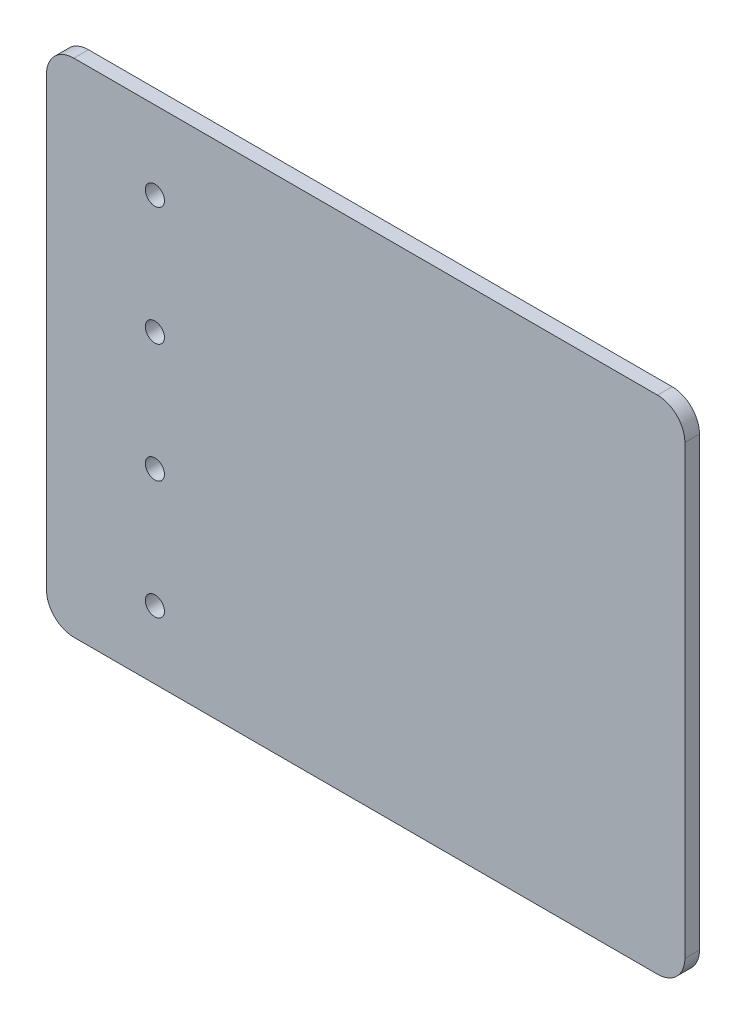
ISO-10303-21;
HEADER;
FILE_DESCRIPTION(('STEP AP214'),'2;1');
FILE_NAME('part.step','',(''),(''),'','','');
FILE_SCHEMA(('AUTOMOTIVE_DESIGN { 1 0 10303 214 1 1 1 1 }'));
ENDSEC;
DATA;
#1=APPLICATION_CONTEXT('core data for automotive mechanical design processes');
#2=APPLICATION_PROTOCOL_DEFINITION('international standard','automotive_design',2000,#1);
#3=PRODUCT_CONTEXT('',#1,'mechanical');
#4=PRODUCT('Part','Part','',(#3));
#5=PRODUCT_RELATED_PRODUCT_CATEGORY('part','',(#4));
#6=PRODUCT_DEFINITION_FORMATION('','',#4);
#7=PRODUCT_DEFINITION_CONTEXT('part definition',#1,'design');
#8=PRODUCT_DEFINITION('design','',#6,#7);
#9=PRODUCT_DEFINITION_SHAPE('','',#8);
#10=(LENGTH_UNIT() NAMED_UNIT(*) SI_UNIT(.MILLI.,.METRE.));
#11=(NAMED_UNIT(*) PLANE_ANGLE_UNIT() SI_UNIT($,.RADIAN.));
#12=(NAMED_UNIT(*) SI_UNIT($,.STERADIAN.) SOLID_ANGLE_UNIT());
#13=UNCERTAINTY_MEASURE_WITH_UNIT(LENGTH_MEASURE(1.E-05),#10,'distance_accuracy_value','');
#14=(GEOMETRIC_REPRESENTATION_CONTEXT(3) GLOBAL_UNCERTAINTY_ASSIGNED_CONTEXT((#13)) GLOBAL_UNIT_ASSIGNED_CONTEXT((#10,
#11,#12)) REPRESENTATION_CONTEXT('',''));
#15=CARTESIAN_POINT('',(0.,0.,0.));
#16=DIRECTION('',(0.,0.,1.));
#17=DIRECTION('',(1.,0.,0.));
#18=AXIS2_PLACEMENT_3D('',#15,#16,#17);
#19=CARTESIAN_POINT('',(35.,-27.5,1.6));
#20=DIRECTION('',(-1.,0.,0.));
#21=DIRECTION('',(0.,0.,1.));
#22=AXIS2_PLACEMENT_3D('',#19,#20,#21);
#23=PLANE('',#22);
#24=DIRECTION('',(0.,1.,0.));
#25=VECTOR('',#24,1.);
#26=CARTESIAN_POINT('',(35.,-27.5,1.6));
#27=LINE('',#26,#25);
#28=CARTESIAN_POINT('',(35.,-24.5,1.6));
#29=VERTEX_POINT('',#28);
#30=CARTESIAN_POINT('',(35.,24.5,1.6));
#31=VERTEX_POINT('',#30);
#32=EDGE_CURVE('E134',#29,#31,#27,.T.);
#33=ORIENTED_EDGE('',*,*,#32,.F.);
#34=DIRECTION('',(0.,0.,-1.));
#35=VECTOR('',#34,1.);
#36=CARTESIAN_POINT('',(35.,-24.5,1.6));
#37=LINE('',#36,#35);
#38=CARTESIAN_POINT('',(35.,-24.5,0.));
#39=VERTEX_POINT('',#38);
#40=EDGE_CURVE('E160',#29,#39,#37,.T.);
#41=ORIENTED_EDGE('',*,*,#40,.T.);
#42=DIRECTION('',(0.,1.,0.));
#43=VECTOR('',#42,1.);
#44=CARTESIAN_POINT('',(35.,-27.5,0.));
#45=LINE('',#44,#43);
#46=CARTESIAN_POINT('',(35.,24.5,0.));
#47=VERTEX_POINT('',#46);
#48=EDGE_CURVE('E166',#39,#47,#45,.T.);
#49=ORIENTED_EDGE('',*,*,#48,.T.);
#50=DIRECTION('',(0.,0.,-1.));
#51=VECTOR('',#50,1.);
#52=CARTESIAN_POINT('',(35.,24.5,1.6));
#53=LINE('',#52,#51);
#54=EDGE_CURVE('E158',#47,#31,#53,.F.);
#55=ORIENTED_EDGE('',*,*,#54,.T.);
#56=EDGE_LOOP('',(#33,#41,#49,#55));
#57=FACE_BOUND('',#56,.T.);
#58=ADVANCED_FACE('F42',(#57),#23,.F.);
#59=CARTESIAN_POINT('',(-35.,27.5,1.6));
#60=DIRECTION('',(0.,-1.,0.));
#61=DIRECTION('',(0.,0.,-1.));
#62=AXIS2_PLACEMENT_3D('',#59,#60,#61);
#63=PLANE('',#62);
#64=DIRECTION('',(-1.,0.,0.));
#65=VECTOR('',#64,1.);
#66=CARTESIAN_POINT('',(-35.,27.5,1.6));
#67=LINE('',#66,#65);
#68=CARTESIAN_POINT('',(32.,27.5,1.6));
#69=VERTEX_POINT('',#68);
#70=CARTESIAN_POINT('',(-32.,27.5,1.6));
#71=VERTEX_POINT('',#70);
#72=EDGE_CURVE('E137',#69,#71,#67,.T.);
#73=ORIENTED_EDGE('',*,*,#72,.F.);
#74=DIRECTION('',(0.,0.,-1.));
#75=VECTOR('',#74,1.);
#76=CARTESIAN_POINT('',(32.,27.5,1.6));
#77=LINE('',#76,#75);
#78=CARTESIAN_POINT('',(32.,27.5,0.));
#79=VERTEX_POINT('',#78);
#80=EDGE_CURVE('E11',#69,#79,#77,.T.);
#81=ORIENTED_EDGE('',*,*,#80,.T.);
#82=DIRECTION('',(-1.,0.,0.));
#83=VECTOR('',#82,1.);
#84=CARTESIAN_POINT('',(-35.,27.5,0.));
#85=LINE('',#84,#83);
#86=CARTESIAN_POINT('',(-32.,27.5,0.));
#87=VERTEX_POINT('',#86);
#88=EDGE_CURVE('E139',#79,#87,#85,.T.);
#89=ORIENTED_EDGE('',*,*,#88,.T.);
#90=DIRECTION('',(0.,0.,-1.));
#91=VECTOR('',#90,1.);
#92=CARTESIAN_POINT('',(-32.,27.5,1.6));
#93=LINE('',#92,#91);
#94=EDGE_CURVE('E50',#87,#71,#93,.F.);
#95=ORIENTED_EDGE('',*,*,#94,.T.);
#96=EDGE_LOOP('',(#73,#81,#89,#95));
#97=FACE_BOUND('',#96,.T.);
#98=ADVANCED_FACE('F234',(#97),#63,.F.);
#99=CARTESIAN_POINT('',(-35.,-27.5,1.6));
#100=DIRECTION('',(1.,0.,0.));
#101=DIRECTION('',(0.,0.,-1.));
#102=AXIS2_PLACEMENT_3D('',#99,#100,#101);
#103=PLANE('',#102);
#104=DIRECTION('',(0.,-1.,0.));
#105=VECTOR('',#104,1.);
#106=CARTESIAN_POINT('',(-35.,-27.5,0.));
#107=LINE('',#106,#105);
#108=CARTESIAN_POINT('',(-35.,24.5,0.));
#109=VERTEX_POINT('',#108);
#110=CARTESIAN_POINT('',(-35.,-24.5,0.));
#111=VERTEX_POINT('',#110);
#112=EDGE_CURVE('E135',#109,#111,#107,.T.);
#113=ORIENTED_EDGE('',*,*,#112,.T.);
#114=DIRECTION('',(0.,0.,-1.));
#115=VECTOR('',#114,1.);
#116=CARTESIAN_POINT('',(-35.,-24.5,1.6));
#117=LINE('',#116,#115);
#118=CARTESIAN_POINT('',(-35.,-24.5,1.6));
#119=VERTEX_POINT('',#118);
#120=EDGE_CURVE('E113',#111,#119,#117,.F.);
#121=ORIENTED_EDGE('',*,*,#120,.T.);
#122=DIRECTION('',(0.,-1.,0.));
#123=VECTOR('',#122,1.);
#124=CARTESIAN_POINT('',(-35.,-27.5,1.6));
#125=LINE('',#124,#123);
#126=CARTESIAN_POINT('',(-35.,24.5,1.6));
#127=VERTEX_POINT('',#126);
#128=EDGE_CURVE('E179',#127,#119,#125,.T.);
#129=ORIENTED_EDGE('',*,*,#128,.F.);
#130=DIRECTION('',(0.,0.,-1.));
#131=VECTOR('',#130,1.);
#132=CARTESIAN_POINT('',(-35.,24.5,1.6));
#133=LINE('',#132,#131);
#134=EDGE_CURVE('E118',#127,#109,#133,.T.);
#135=ORIENTED_EDGE('',*,*,#134,.T.);
#136=EDGE_LOOP('',(#113,#121,#129,#135));
#137=FACE_BOUND('',#136,.T.);
#138=ADVANCED_FACE('F239',(#137),#103,.F.);
#139=CARTESIAN_POINT('',(-35.,-27.5,1.6));
#140=DIRECTION('',(0.,1.,0.));
#141=DIRECTION('',(0.,0.,1.));
#142=AXIS2_PLACEMENT_3D('',#139,#140,#141);
#143=PLANE('',#142);
#144=DIRECTION('',(1.,0.,0.));
#145=VECTOR('',#144,1.);
#146=CARTESIAN_POINT('',(-35.,-27.5,1.6));
#147=LINE('',#146,#145);
#148=CARTESIAN_POINT('',(-32.,-27.5,1.6));
#149=VERTEX_POINT('',#148);
#150=CARTESIAN_POINT('',(32.,-27.5,1.6));
#151=VERTEX_POINT('',#150);
#152=EDGE_CURVE('E128',#149,#151,#147,.T.);
#153=ORIENTED_EDGE('',*,*,#152,.F.);
#154=DIRECTION('',(0.,0.,-1.));
#155=VECTOR('',#154,1.);
#156=CARTESIAN_POINT('',(-32.,-27.5,1.6));
#157=LINE('',#156,#155);
#158=CARTESIAN_POINT('',(-32.,-27.5,0.));
#159=VERTEX_POINT('',#158);
#160=EDGE_CURVE('E112',#149,#159,#157,.T.);
#161=ORIENTED_EDGE('',*,*,#160,.T.);
#162=DIRECTION('',(1.,0.,0.));
#163=VECTOR('',#162,1.);
#164=CARTESIAN_POINT('',(-35.,-27.5,0.));
#165=LINE('',#164,#163);
#166=CARTESIAN_POINT('',(32.,-27.5,0.));
#167=VERTEX_POINT('',#166);
#168=EDGE_CURVE('E125',#159,#167,#165,.T.);
#169=ORIENTED_EDGE('',*,*,#168,.T.);
#170=DIRECTION('',(0.,0.,-1.));
#171=VECTOR('',#170,1.);
#172=CARTESIAN_POINT('',(32.,-27.5,1.6));
#173=LINE('',#172,#171);
#174=EDGE_CURVE('E130',#167,#151,#173,.F.);
#175=ORIENTED_EDGE('',*,*,#174,.T.);
#176=EDGE_LOOP('',(#153,#161,#169,#175));
#177=FACE_BOUND('',#176,.T.);
#178=ADVANCED_FACE('F124',(#177),#143,.F.);
#179=CARTESIAN_POINT('',(0.,0.,1.6));
#180=DIRECTION('',(0.,0.,-1.));
#181=DIRECTION('',(-1.,0.,0.));
#182=AXIS2_PLACEMENT_3D('',#179,#180,#181);
#183=PLANE('',#182);
#184=CARTESIAN_POINT('',(-23.118003477685,-20.06669,1.6));
#185=DIRECTION('',(0.,0.,-1.));
#186=DIRECTION('',(-1.,0.,0.));
#187=AXIS2_PLACEMENT_3D('',#184,#185,#186);
#188=CIRCLE('',#187,1.04999999999999);
#189=CARTESIAN_POINT('',(-24.168003477685,-20.06669,1.6));
#190=VERTEX_POINT('',#189);
#191=EDGE_CURVE('E171',#190,#190,#188,.T.);
#192=ORIENTED_EDGE('',*,*,#191,.T.);
#193=EDGE_LOOP('',(#192));
#194=FACE_BOUND('',#193,.T.);
#195=CARTESIAN_POINT('',(-23.118003477685,-7.06668999999999,1.6));
#196=DIRECTION('',(0.,0.,-1.));
#197=DIRECTION('',(-1.,0.,0.));
#198=AXIS2_PLACEMENT_3D('',#195,#196,#197);
#199=CIRCLE('',#198,1.04999999999999);
#200=CARTESIAN_POINT('',(-24.168003477685,-7.06668999999999,1.6));
#201=VERTEX_POINT('',#200);
#202=EDGE_CURVE('E199',#201,#201,#199,.T.);
#203=ORIENTED_EDGE('',*,*,#202,.T.);
#204=EDGE_LOOP('',(#203));
#205=FACE_BOUND('',#204,.T.);
#206=CARTESIAN_POINT('',(-23.118003477685,5.93331,1.6));
#207=DIRECTION('',(0.,0.,-1.));
#208=DIRECTION('',(-1.,0.,0.));
#209=AXIS2_PLACEMENT_3D('',#206,#207,#208);
#210=CIRCLE('',#209,1.04999999999999);
#211=CARTESIAN_POINT('',(-24.168003477685,5.93331,1.6));
#212=VERTEX_POINT('',#211);
#213=EDGE_CURVE('E193',#212,#212,#210,.T.);
#214=ORIENTED_EDGE('',*,*,#213,.T.);
#215=EDGE_LOOP('',(#214));
#216=FACE_BOUND('',#215,.T.);
#217=CARTESIAN_POINT('',(-23.118003477685,18.93331,1.6));
#218=DIRECTION('',(0.,0.,-1.));
#219=DIRECTION('',(-1.,0.,0.));
#220=AXIS2_PLACEMENT_3D('',#217,#218,#219);
#221=CIRCLE('',#220,1.04999999999999);
#222=CARTESIAN_POINT('',(-24.168003477685,18.93331,1.6));
#223=VERTEX_POINT('',#222);
#224=EDGE_CURVE('E187',#223,#223,#221,.T.);
#225=ORIENTED_EDGE('',*,*,#224,.T.);
#226=EDGE_LOOP('',(#225));
#227=FACE_BOUND('',#226,.T.);
#228=ORIENTED_EDGE('',*,*,#128,.T.);
#229=CARTESIAN_POINT('',(-32.,-24.5,1.6));
#230=DIRECTION('',(0.,0.,-1.));
#231=DIRECTION('',(-1.,0.,0.));
#232=AXIS2_PLACEMENT_3D('',#229,#230,#231);
#233=CIRCLE('',#232,3.);
#234=EDGE_CURVE('E156',#119,#149,#233,.F.);
#235=ORIENTED_EDGE('',*,*,#234,.T.);
#236=ORIENTED_EDGE('',*,*,#152,.T.);
#237=CARTESIAN_POINT('',(32.,-24.5,1.6));
#238=DIRECTION('',(0.,0.,-1.));
#239=DIRECTION('',(-1.,0.,0.));
#240=AXIS2_PLACEMENT_3D('',#237,#238,#239);
#241=CIRCLE('',#240,3.);
#242=EDGE_CURVE('E154',#151,#29,#241,.F.);
#243=ORIENTED_EDGE('',*,*,#242,.T.);
#244=ORIENTED_EDGE('',*,*,#32,.T.);
#245=CARTESIAN_POINT('',(32.,24.5,1.6));
#246=DIRECTION('',(0.,0.,-1.));
#247=DIRECTION('',(-1.,0.,0.));
#248=AXIS2_PLACEMENT_3D('',#245,#246,#247);
#249=CIRCLE('',#248,3.);
#250=EDGE_CURVE('E63',#31,#69,#249,.F.);
#251=ORIENTED_EDGE('',*,*,#250,.T.);
#252=ORIENTED_EDGE('',*,*,#72,.T.);
#253=CARTESIAN_POINT('',(-32.,24.5,1.6));
#254=DIRECTION('',(0.,0.,-1.));
#255=DIRECTION('',(-1.,0.,0.));
#256=AXIS2_PLACEMENT_3D('',#253,#254,#255);
#257=CIRCLE('',#256,3.);
#258=EDGE_CURVE('E151',#71,#127,#257,.F.);
#259=ORIENTED_EDGE('',*,*,#258,.T.);
#260=EDGE_LOOP('',(#228,#235,#236,#243,#244,#251,#252,#259));
#261=FACE_BOUND('',#260,.T.);
#262=ADVANCED_FACE('F209',(#194,#205,#216,#227,#261),#183,.F.);
#263=CARTESIAN_POINT('',(0.,0.,0.));
#264=DIRECTION('',(0.,0.,-1.));
#265=DIRECTION('',(-1.,0.,0.));
#266=AXIS2_PLACEMENT_3D('',#263,#264,#265);
#267=PLANE('',#266);
#268=CARTESIAN_POINT('',(-23.118003477685,-20.06669,0.));
#269=DIRECTION('',(0.,0.,-1.));
#270=DIRECTION('',(-1.,0.,0.));
#271=AXIS2_PLACEMENT_3D('',#268,#269,#270);
#272=CIRCLE('',#271,1.04999999999999);
#273=CARTESIAN_POINT('',(-24.168003477685,-20.06669,0.));
#274=VERTEX_POINT('',#273);
#275=EDGE_CURVE('E175',#274,#274,#272,.T.);
#276=ORIENTED_EDGE('',*,*,#275,.F.);
#277=EDGE_LOOP('',(#276));
#278=FACE_BOUND('',#277,.T.);
#279=CARTESIAN_POINT('',(-23.118003477685,-7.06668999999999,0.));
#280=DIRECTION('',(0.,0.,-1.));
#281=DIRECTION('',(-1.,0.,0.));
#282=AXIS2_PLACEMENT_3D('',#279,#280,#281);
#283=CIRCLE('',#282,1.04999999999999);
#284=CARTESIAN_POINT('',(-24.168003477685,-7.06668999999999,0.));
#285=VERTEX_POINT('',#284);
#286=EDGE_CURVE('E196',#285,#285,#283,.T.);
#287=ORIENTED_EDGE('',*,*,#286,.F.);
#288=EDGE_LOOP('',(#287));
#289=FACE_BOUND('',#288,.T.);
#290=CARTESIAN_POINT('',(-23.118003477685,5.93331,0.));
#291=DIRECTION('',(0.,0.,-1.));
#292=DIRECTION('',(-1.,0.,0.));
#293=AXIS2_PLACEMENT_3D('',#290,#291,#292);
#294=CIRCLE('',#293,1.04999999999999);
#295=CARTESIAN_POINT('',(-24.168003477685,5.93331,0.));
#296=VERTEX_POINT('',#295);
#297=EDGE_CURVE('E190',#296,#296,#294,.T.);
#298=ORIENTED_EDGE('',*,*,#297,.F.);
#299=EDGE_LOOP('',(#298));
#300=FACE_BOUND('',#299,.T.);
#301=CARTESIAN_POINT('',(-23.118003477685,18.93331,0.));
#302=DIRECTION('',(0.,0.,-1.));
#303=DIRECTION('',(-1.,0.,0.));
#304=AXIS2_PLACEMENT_3D('',#301,#302,#303);
#305=CIRCLE('',#304,1.04999999999999);
#306=CARTESIAN_POINT('',(-24.168003477685,18.93331,0.));
#307=VERTEX_POINT('',#306);
#308=EDGE_CURVE('E184',#307,#307,#305,.T.);
#309=ORIENTED_EDGE('',*,*,#308,.F.);
#310=EDGE_LOOP('',(#309));
#311=FACE_BOUND('',#310,.T.);
#312=ORIENTED_EDGE('',*,*,#168,.F.);
#313=CARTESIAN_POINT('',(-32.,-24.5,0.));
#314=DIRECTION('',(0.,0.,-1.));
#315=DIRECTION('',(-1.,0.,0.));
#316=AXIS2_PLACEMENT_3D('',#313,#314,#315);
#317=CIRCLE('',#316,3.);
#318=EDGE_CURVE('E108',#159,#111,#317,.T.);
#319=ORIENTED_EDGE('',*,*,#318,.T.);
#320=ORIENTED_EDGE('',*,*,#112,.F.);
#321=CARTESIAN_POINT('',(-32.,24.5,0.));
#322=DIRECTION('',(0.,0.,-1.));
#323=DIRECTION('',(-1.,0.,0.));
#324=AXIS2_PLACEMENT_3D('',#321,#322,#323);
#325=CIRCLE('',#324,3.);
#326=EDGE_CURVE('E129',#109,#87,#325,.T.);
#327=ORIENTED_EDGE('',*,*,#326,.T.);
#328=ORIENTED_EDGE('',*,*,#88,.F.);
#329=CARTESIAN_POINT('',(32.,24.5,0.));
#330=DIRECTION('',(0.,0.,-1.));
#331=DIRECTION('',(-1.,0.,0.));
#332=AXIS2_PLACEMENT_3D('',#329,#330,#331);
#333=CIRCLE('',#332,3.);
#334=EDGE_CURVE('E145',#79,#47,#333,.T.);
#335=ORIENTED_EDGE('',*,*,#334,.T.);
#336=ORIENTED_EDGE('',*,*,#48,.F.);
#337=CARTESIAN_POINT('',(32.,-24.5,0.));
#338=DIRECTION('',(0.,0.,-1.));
#339=DIRECTION('',(-1.,0.,0.));
#340=AXIS2_PLACEMENT_3D('',#337,#338,#339);
#341=CIRCLE('',#340,3.);
#342=EDGE_CURVE('E119',#39,#167,#341,.T.);
#343=ORIENTED_EDGE('',*,*,#342,.T.);
#344=EDGE_LOOP('',(#312,#319,#320,#327,#328,#335,#336,#343));
#345=FACE_BOUND('',#344,.T.);
#346=ADVANCED_FACE('F132',(#278,#289,#300,#311,#345),#267,.T.);
#347=CARTESIAN_POINT('',(-32.,-24.5,1.6));
#348=DIRECTION('',(0.,0.,-1.));
#349=DIRECTION('',(-1.,0.,0.));
#350=AXIS2_PLACEMENT_3D('',#347,#348,#349);
#351=CYLINDRICAL_SURFACE('',#350,3.);
#352=ORIENTED_EDGE('',*,*,#234,.F.);
#353=ORIENTED_EDGE('',*,*,#120,.F.);
#354=ORIENTED_EDGE('',*,*,#318,.F.);
#355=ORIENTED_EDGE('',*,*,#160,.F.);
#356=EDGE_LOOP('',(#352,#353,#354,#355));
#357=FACE_BOUND('',#356,.T.);
#358=ADVANCED_FACE('F111',(#357),#351,.T.);
#359=CARTESIAN_POINT('',(32.,-24.5,1.6));
#360=DIRECTION('',(0.,0.,-1.));
#361=DIRECTION('',(-1.,0.,0.));
#362=AXIS2_PLACEMENT_3D('',#359,#360,#361);
#363=CYLINDRICAL_SURFACE('',#362,3.);
#364=ORIENTED_EDGE('',*,*,#242,.F.);
#365=ORIENTED_EDGE('',*,*,#174,.F.);
#366=ORIENTED_EDGE('',*,*,#342,.F.);
#367=ORIENTED_EDGE('',*,*,#40,.F.);
#368=EDGE_LOOP('',(#364,#365,#366,#367));
#369=FACE_BOUND('',#368,.T.);
#370=ADVANCED_FACE('F245',(#369),#363,.T.);
#371=CARTESIAN_POINT('',(32.,24.5,1.6));
#372=DIRECTION('',(0.,0.,-1.));
#373=DIRECTION('',(-1.,0.,0.));
#374=AXIS2_PLACEMENT_3D('',#371,#372,#373);
#375=CYLINDRICAL_SURFACE('',#374,3.);
#376=ORIENTED_EDGE('',*,*,#250,.F.);
#377=ORIENTED_EDGE('',*,*,#54,.F.);
#378=ORIENTED_EDGE('',*,*,#334,.F.);
#379=ORIENTED_EDGE('',*,*,#80,.F.);
#380=EDGE_LOOP('',(#376,#377,#378,#379));
#381=FACE_BOUND('',#380,.T.);
#382=ADVANCED_FACE('F229',(#381),#375,.T.);
#383=CARTESIAN_POINT('',(-32.,24.5,1.6));
#384=DIRECTION('',(0.,0.,-1.));
#385=DIRECTION('',(-1.,0.,0.));
#386=AXIS2_PLACEMENT_3D('',#383,#384,#385);
#387=CYLINDRICAL_SURFACE('',#386,3.);
#388=ORIENTED_EDGE('',*,*,#258,.F.);
#389=ORIENTED_EDGE('',*,*,#94,.F.);
#390=ORIENTED_EDGE('',*,*,#326,.F.);
#391=ORIENTED_EDGE('',*,*,#134,.F.);
#392=EDGE_LOOP('',(#388,#389,#390,#391));
#393=FACE_BOUND('',#392,.T.);
#394=ADVANCED_FACE('F44',(#393),#387,.T.);
#395=CARTESIAN_POINT('',(-23.118003477685,18.93331,1.6));
#396=DIRECTION('',(0.,0.,-1.));
#397=DIRECTION('',(-1.,0.,0.));
#398=AXIS2_PLACEMENT_3D('',#395,#396,#397);
#399=CYLINDRICAL_SURFACE('',#398,1.04999999999999);
#400=ORIENTED_EDGE('',*,*,#224,.F.);
#401=EDGE_LOOP('',(#400));
#402=FACE_BOUND('',#401,.T.);
#403=ORIENTED_EDGE('',*,*,#308,.T.);
#404=EDGE_LOOP('',(#403));
#405=FACE_BOUND('',#404,.T.);
#406=ADVANCED_FACE('F217',(#402,#405),#399,.F.);
#407=CARTESIAN_POINT('',(-23.118003477685,5.93331,1.6));
#408=DIRECTION('',(0.,0.,-1.));
#409=DIRECTION('',(-1.,0.,0.));
#410=AXIS2_PLACEMENT_3D('',#407,#408,#409);
#411=CYLINDRICAL_SURFACE('',#410,1.04999999999999);
#412=ORIENTED_EDGE('',*,*,#213,.F.);
#413=EDGE_LOOP('',(#412));
#414=FACE_BOUND('',#413,.T.);
#415=ORIENTED_EDGE('',*,*,#297,.T.);
#416=EDGE_LOOP('',(#415));
#417=FACE_BOUND('',#416,.T.);
#418=ADVANCED_FACE('F219',(#414,#417),#411,.F.);
#419=CARTESIAN_POINT('',(-23.118003477685,-7.06668999999999,1.6));
#420=DIRECTION('',(0.,0.,-1.));
#421=DIRECTION('',(-1.,0.,0.));
#422=AXIS2_PLACEMENT_3D('',#419,#420,#421);
#423=CYLINDRICAL_SURFACE('',#422,1.04999999999999);
#424=ORIENTED_EDGE('',*,*,#202,.F.);
#425=EDGE_LOOP('',(#424));
#426=FACE_BOUND('',#425,.T.);
#427=ORIENTED_EDGE('',*,*,#286,.T.);
#428=EDGE_LOOP('',(#427));
#429=FACE_BOUND('',#428,.T.);
#430=ADVANCED_FACE('F226',(#426,#429),#423,.F.);
#431=CARTESIAN_POINT('',(-23.118003477685,-20.06669,1.6));
#432=DIRECTION('',(0.,0.,-1.));
#433=DIRECTION('',(-1.,0.,0.));
#434=AXIS2_PLACEMENT_3D('',#431,#432,#433);
#435=CYLINDRICAL_SURFACE('',#434,1.04999999999999);
#436=ORIENTED_EDGE('',*,*,#191,.F.);
#437=EDGE_LOOP('',(#436));
#438=FACE_BOUND('',#437,.T.);
#439=ORIENTED_EDGE('',*,*,#275,.T.);
#440=EDGE_LOOP('',(#439));
#441=FACE_BOUND('',#440,.T.);
#442=ADVANCED_FACE('F205',(#438,#441),#435,.F.);
#443=CLOSED_SHELL('',(#58,#98,#138,#178,#262,#346,#358,#370,#382,#394,#406,#418,#430,#442));
#444=MANIFOLD_SOLID_BREP('B2',#443);
#445=ADVANCED_BREP_SHAPE_REPRESENTATION('',(#18,#444),#14);
#446=SHAPE_DEFINITION_REPRESENTATION(#9,#445);
ENDSEC;
END-ISO-10303-21;
